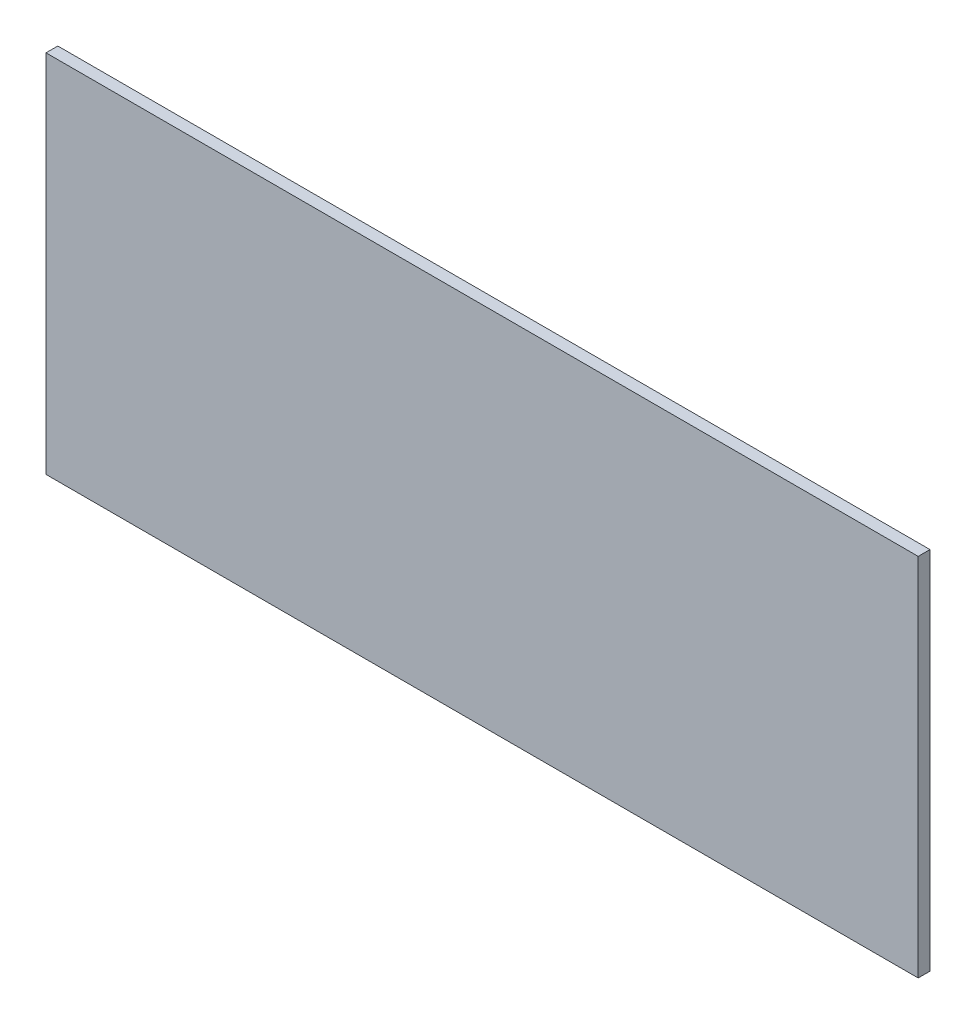
ISO-10303-21;
HEADER;
FILE_DESCRIPTION(('STEP AP214'),'2;1');
FILE_NAME('part.step','',(''),(''),'','','');
FILE_SCHEMA(('AUTOMOTIVE_DESIGN { 1 0 10303 214 1 1 1 1 }'));
ENDSEC;
DATA;
#1=APPLICATION_CONTEXT('core data for automotive mechanical design processes');
#2=APPLICATION_PROTOCOL_DEFINITION('international standard','automotive_design',2000,#1);
#3=PRODUCT_CONTEXT('',#1,'mechanical');
#4=PRODUCT('Part','Part','',(#3));
#5=PRODUCT_RELATED_PRODUCT_CATEGORY('part','',(#4));
#6=PRODUCT_DEFINITION_FORMATION('','',#4);
#7=PRODUCT_DEFINITION_CONTEXT('part definition',#1,'design');
#8=PRODUCT_DEFINITION('design','',#6,#7);
#9=PRODUCT_DEFINITION_SHAPE('','',#8);
#10=(LENGTH_UNIT() NAMED_UNIT(*) SI_UNIT(.MILLI.,.METRE.));
#11=(NAMED_UNIT(*) PLANE_ANGLE_UNIT() SI_UNIT($,.RADIAN.));
#12=(NAMED_UNIT(*) SI_UNIT($,.STERADIAN.) SOLID_ANGLE_UNIT());
#13=UNCERTAINTY_MEASURE_WITH_UNIT(LENGTH_MEASURE(1.E-05),#10,'distance_accuracy_value','');
#14=(GEOMETRIC_REPRESENTATION_CONTEXT(3) GLOBAL_UNCERTAINTY_ASSIGNED_CONTEXT((#13)) GLOBAL_UNIT_ASSIGNED_CONTEXT((#10,
#11,#12)) REPRESENTATION_CONTEXT('',''));
#15=CARTESIAN_POINT('',(0.,0.,0.));
#16=DIRECTION('',(0.,0.,1.));
#17=DIRECTION('',(1.,0.,0.));
#18=AXIS2_PLACEMENT_3D('',#15,#16,#17);
#19=CARTESIAN_POINT('',(0.,0.,1.51892));
#20=DIRECTION('',(1.,0.,0.));
#21=DIRECTION('',(0.,0.,-1.));
#22=AXIS2_PLACEMENT_3D('',#19,#20,#21);
#23=PLANE('',#22);
#24=DIRECTION('',(0.,-1.,0.));
#25=VECTOR('',#24,1.);
#26=CARTESIAN_POINT('',(0.,0.,0.));
#27=LINE('',#26,#25);
#28=CARTESIAN_POINT('',(0.,47.,0.));
#29=VERTEX_POINT('',#28);
#30=CARTESIAN_POINT('',(0.,0.,0.));
#31=VERTEX_POINT('',#30);
#32=EDGE_CURVE('E97',#29,#31,#27,.T.);
#33=ORIENTED_EDGE('',*,*,#32,.T.);
#34=DIRECTION('',(0.,0.,-1.));
#35=VECTOR('',#34,1.);
#36=CARTESIAN_POINT('',(0.,0.,1.51892));
#37=LINE('',#36,#35);
#38=CARTESIAN_POINT('',(0.,0.,1.51892));
#39=VERTEX_POINT('',#38);
#40=EDGE_CURVE('E11',#39,#31,#37,.T.);
#41=ORIENTED_EDGE('',*,*,#40,.F.);
#42=DIRECTION('',(0.,-1.,0.));
#43=VECTOR('',#42,1.);
#44=CARTESIAN_POINT('',(0.,0.,1.51892));
#45=LINE('',#44,#43);
#46=CARTESIAN_POINT('',(0.,47.,1.51892));
#47=VERTEX_POINT('',#46);
#48=EDGE_CURVE('E85',#47,#39,#45,.T.);
#49=ORIENTED_EDGE('',*,*,#48,.F.);
#50=DIRECTION('',(0.,0.,-1.));
#51=VECTOR('',#50,1.);
#52=CARTESIAN_POINT('',(0.,47.,1.51892));
#53=LINE('',#52,#51);
#54=EDGE_CURVE('E93',#47,#29,#53,.T.);
#55=ORIENTED_EDGE('',*,*,#54,.T.);
#56=EDGE_LOOP('',(#33,#41,#49,#55));
#57=FACE_BOUND('',#56,.T.);
#58=ADVANCED_FACE('F34',(#57),#23,.F.);
#59=CARTESIAN_POINT('',(0.,0.,1.51892));
#60=DIRECTION('',(0.,1.,0.));
#61=DIRECTION('',(0.,0.,1.));
#62=AXIS2_PLACEMENT_3D('',#59,#60,#61);
#63=PLANE('',#62);
#64=DIRECTION('',(1.,0.,0.));
#65=VECTOR('',#64,1.);
#66=CARTESIAN_POINT('',(0.,0.,0.));
#67=LINE('',#66,#65);
#68=CARTESIAN_POINT('',(112.268,0.,0.));
#69=VERTEX_POINT('',#68);
#70=EDGE_CURVE('E89',#31,#69,#67,.T.);
#71=ORIENTED_EDGE('',*,*,#70,.T.);
#72=DIRECTION('',(0.,0.,-1.));
#73=VECTOR('',#72,1.);
#74=CARTESIAN_POINT('',(112.268,0.,1.51892));
#75=LINE('',#74,#73);
#76=CARTESIAN_POINT('',(112.268,0.,1.51892));
#77=VERTEX_POINT('',#76);
#78=EDGE_CURVE('E42',#77,#69,#75,.T.);
#79=ORIENTED_EDGE('',*,*,#78,.F.);
#80=DIRECTION('',(1.,0.,0.));
#81=VECTOR('',#80,1.);
#82=CARTESIAN_POINT('',(0.,0.,1.51892));
#83=LINE('',#82,#81);
#84=EDGE_CURVE('E80',#39,#77,#83,.T.);
#85=ORIENTED_EDGE('',*,*,#84,.F.);
#86=ORIENTED_EDGE('',*,*,#40,.T.);
#87=EDGE_LOOP('',(#71,#79,#85,#86));
#88=FACE_BOUND('',#87,.T.);
#89=ADVANCED_FACE('F88',(#88),#63,.F.);
#90=CARTESIAN_POINT('',(112.268,0.,1.51892));
#91=DIRECTION('',(-1.,0.,0.));
#92=DIRECTION('',(0.,0.,1.));
#93=AXIS2_PLACEMENT_3D('',#90,#91,#92);
#94=PLANE('',#93);
#95=DIRECTION('',(0.,1.,0.));
#96=VECTOR('',#95,1.);
#97=CARTESIAN_POINT('',(112.268,0.,0.));
#98=LINE('',#97,#96);
#99=CARTESIAN_POINT('',(112.268,47.,0.));
#100=VERTEX_POINT('',#99);
#101=EDGE_CURVE('E67',#69,#100,#98,.T.);
#102=ORIENTED_EDGE('',*,*,#101,.T.);
#103=DIRECTION('',(0.,0.,-1.));
#104=VECTOR('',#103,1.);
#105=CARTESIAN_POINT('',(112.268,47.,1.51892));
#106=LINE('',#105,#104);
#107=CARTESIAN_POINT('',(112.268,47.,1.51892));
#108=VERTEX_POINT('',#107);
#109=EDGE_CURVE('E90',#108,#100,#106,.T.);
#110=ORIENTED_EDGE('',*,*,#109,.F.);
#111=DIRECTION('',(0.,1.,0.));
#112=VECTOR('',#111,1.);
#113=CARTESIAN_POINT('',(112.268,0.,1.51892));
#114=LINE('',#113,#112);
#115=EDGE_CURVE('E83',#77,#108,#114,.T.);
#116=ORIENTED_EDGE('',*,*,#115,.F.);
#117=ORIENTED_EDGE('',*,*,#78,.T.);
#118=EDGE_LOOP('',(#102,#110,#116,#117));
#119=FACE_BOUND('',#118,.T.);
#120=ADVANCED_FACE('F91',(#119),#94,.F.);
#121=CARTESIAN_POINT('',(0.,47.,1.51892));
#122=DIRECTION('',(0.,-1.,0.));
#123=DIRECTION('',(0.,0.,-1.));
#124=AXIS2_PLACEMENT_3D('',#121,#122,#123);
#125=PLANE('',#124);
#126=DIRECTION('',(-1.,0.,0.));
#127=VECTOR('',#126,1.);
#128=CARTESIAN_POINT('',(0.,47.,0.));
#129=LINE('',#128,#127);
#130=EDGE_CURVE('E73',#100,#29,#129,.T.);
#131=ORIENTED_EDGE('',*,*,#130,.T.);
#132=ORIENTED_EDGE('',*,*,#54,.F.);
#133=DIRECTION('',(-1.,0.,0.));
#134=VECTOR('',#133,1.);
#135=CARTESIAN_POINT('',(0.,47.,1.51892));
#136=LINE('',#135,#134);
#137=EDGE_CURVE('E50',#108,#47,#136,.T.);
#138=ORIENTED_EDGE('',*,*,#137,.F.);
#139=ORIENTED_EDGE('',*,*,#109,.T.);
#140=EDGE_LOOP('',(#131,#132,#138,#139));
#141=FACE_BOUND('',#140,.T.);
#142=ADVANCED_FACE('F104',(#141),#125,.F.);
#143=CARTESIAN_POINT('',(0.,0.,1.51892));
#144=DIRECTION('',(0.,0.,-1.));
#145=DIRECTION('',(-1.,0.,0.));
#146=AXIS2_PLACEMENT_3D('',#143,#144,#145);
#147=PLANE('',#146);
#148=ORIENTED_EDGE('',*,*,#48,.T.);
#149=ORIENTED_EDGE('',*,*,#84,.T.);
#150=ORIENTED_EDGE('',*,*,#115,.T.);
#151=ORIENTED_EDGE('',*,*,#137,.T.);
#152=EDGE_LOOP('',(#148,#149,#150,#151));
#153=FACE_BOUND('',#152,.T.);
#154=ADVANCED_FACE('F81',(#153),#147,.F.);
#155=CARTESIAN_POINT('',(0.,0.,0.));
#156=DIRECTION('',(0.,0.,-1.));
#157=DIRECTION('',(-1.,0.,0.));
#158=AXIS2_PLACEMENT_3D('',#155,#156,#157);
#159=PLANE('',#158);
#160=ORIENTED_EDGE('',*,*,#32,.F.);
#161=ORIENTED_EDGE('',*,*,#130,.F.);
#162=ORIENTED_EDGE('',*,*,#101,.F.);
#163=ORIENTED_EDGE('',*,*,#70,.F.);
#164=EDGE_LOOP('',(#160,#161,#162,#163));
#165=FACE_BOUND('',#164,.T.);
#166=ADVANCED_FACE('F107',(#165),#159,.T.);
#167=CLOSED_SHELL('',(#58,#89,#120,#142,#154,#166));
#168=MANIFOLD_SOLID_BREP('B2',#167);
#169=ADVANCED_BREP_SHAPE_REPRESENTATION('',(#18,#168),#14);
#170=SHAPE_DEFINITION_REPRESENTATION(#9,#169);
ENDSEC;
END-ISO-10303-21;
